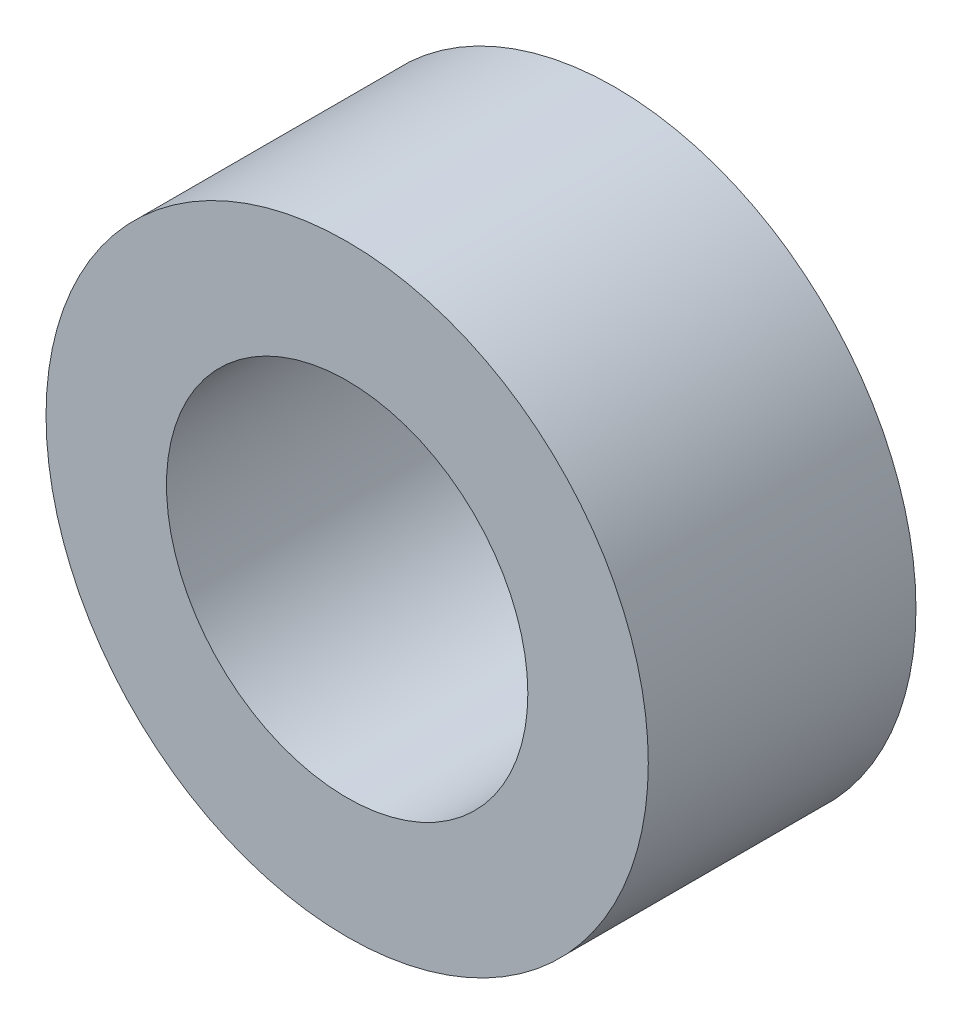
ISO-10303-21;
HEADER;
FILE_DESCRIPTION(('STEP AP214'),'2;1');
FILE_NAME('part.step','',(''),(''),'','','');
FILE_SCHEMA(('AUTOMOTIVE_DESIGN { 1 0 10303 214 1 1 1 1 }'));
ENDSEC;
DATA;
#1=APPLICATION_CONTEXT('core data for automotive mechanical design processes');
#2=APPLICATION_PROTOCOL_DEFINITION('international standard','automotive_design',2000,#1);
#3=PRODUCT_CONTEXT('',#1,'mechanical');
#4=PRODUCT('Part','Part','',(#3));
#5=PRODUCT_RELATED_PRODUCT_CATEGORY('part','',(#4));
#6=PRODUCT_DEFINITION_FORMATION('','',#4);
#7=PRODUCT_DEFINITION_CONTEXT('part definition',#1,'design');
#8=PRODUCT_DEFINITION('design','',#6,#7);
#9=PRODUCT_DEFINITION_SHAPE('','',#8);
#10=(LENGTH_UNIT() NAMED_UNIT(*) SI_UNIT(.MILLI.,.METRE.));
#11=(NAMED_UNIT(*) PLANE_ANGLE_UNIT() SI_UNIT($,.RADIAN.));
#12=(NAMED_UNIT(*) SI_UNIT($,.STERADIAN.) SOLID_ANGLE_UNIT());
#13=UNCERTAINTY_MEASURE_WITH_UNIT(LENGTH_MEASURE(1.E-05),#10,'distance_accuracy_value','');
#14=(GEOMETRIC_REPRESENTATION_CONTEXT(3) GLOBAL_UNCERTAINTY_ASSIGNED_CONTEXT((#13)) GLOBAL_UNIT_ASSIGNED_CONTEXT((#10,
#11,#12)) REPRESENTATION_CONTEXT('',''));
#15=CARTESIAN_POINT('',(0.,0.,0.));
#16=DIRECTION('',(0.,0.,1.));
#17=DIRECTION('',(1.,0.,0.));
#18=AXIS2_PLACEMENT_3D('',#15,#16,#17);
#19=CARTESIAN_POINT('',(0.,0.,1.));
#20=DIRECTION('',(0.,0.,1.));
#21=DIRECTION('',(1.,0.,0.));
#22=AXIS2_PLACEMENT_3D('',#19,#20,#21);
#23=PLANE('',#22);
#24=CARTESIAN_POINT('',(0.,0.,1.));
#25=DIRECTION('',(0.,0.,1.));
#26=DIRECTION('',(1.,0.,0.));
#27=AXIS2_PLACEMENT_3D('',#24,#25,#26);
#28=CIRCLE('',#27,2.25);
#29=CARTESIAN_POINT('',(2.25,0.,1.));
#30=VERTEX_POINT('',#29);
#31=EDGE_CURVE('E10',#30,#30,#28,.T.);
#32=ORIENTED_EDGE('',*,*,#31,.T.);
#33=EDGE_LOOP('',(#32));
#34=FACE_BOUND('',#33,.T.);
#35=CARTESIAN_POINT('',(0.,0.,1.));
#36=DIRECTION('',(0.,0.,1.));
#37=DIRECTION('',(1.,0.,0.));
#38=AXIS2_PLACEMENT_3D('',#35,#36,#37);
#39=CIRCLE('',#38,1.35);
#40=CARTESIAN_POINT('',(1.35,0.,1.));
#41=VERTEX_POINT('',#40);
#42=EDGE_CURVE('E48',#41,#41,#39,.T.);
#43=ORIENTED_EDGE('',*,*,#42,.F.);
#44=EDGE_LOOP('',(#43));
#45=FACE_BOUND('',#44,.T.);
#46=ADVANCED_FACE('F34',(#34,#45),#23,.T.);
#47=CARTESIAN_POINT('',(0.,0.,-1.));
#48=DIRECTION('',(0.,0.,1.));
#49=DIRECTION('',(1.,0.,0.));
#50=AXIS2_PLACEMENT_3D('',#47,#48,#49);
#51=PLANE('',#50);
#52=CARTESIAN_POINT('',(0.,0.,-1.));
#53=DIRECTION('',(0.,0.,1.));
#54=DIRECTION('',(1.,0.,0.));
#55=AXIS2_PLACEMENT_3D('',#52,#53,#54);
#56=CIRCLE('',#55,2.25);
#57=CARTESIAN_POINT('',(2.25,0.,-1.));
#58=VERTEX_POINT('',#57);
#59=EDGE_CURVE('E38',#58,#58,#56,.T.);
#60=ORIENTED_EDGE('',*,*,#59,.F.);
#61=EDGE_LOOP('',(#60));
#62=FACE_BOUND('',#61,.T.);
#63=CARTESIAN_POINT('',(0.,0.,-1.));
#64=DIRECTION('',(0.,0.,1.));
#65=DIRECTION('',(1.,0.,0.));
#66=AXIS2_PLACEMENT_3D('',#63,#64,#65);
#67=CIRCLE('',#66,1.35);
#68=CARTESIAN_POINT('',(1.35,0.,-1.));
#69=VERTEX_POINT('',#68);
#70=EDGE_CURVE('E50',#69,#69,#67,.T.);
#71=ORIENTED_EDGE('',*,*,#70,.T.);
#72=EDGE_LOOP('',(#71));
#73=FACE_BOUND('',#72,.T.);
#74=ADVANCED_FACE('F61',(#62,#73),#51,.F.);
#75=CARTESIAN_POINT('',(0.,0.,1.));
#76=DIRECTION('',(0.,0.,-1.));
#77=DIRECTION('',(-1.,0.,0.));
#78=AXIS2_PLACEMENT_3D('',#75,#76,#77);
#79=CYLINDRICAL_SURFACE('',#78,2.25);
#80=ORIENTED_EDGE('',*,*,#31,.F.);
#81=EDGE_LOOP('',(#80));
#82=FACE_BOUND('',#81,.T.);
#83=ORIENTED_EDGE('',*,*,#59,.T.);
#84=EDGE_LOOP('',(#83));
#85=FACE_BOUND('',#84,.T.);
#86=ADVANCED_FACE('F36',(#82,#85),#79,.T.);
#87=CARTESIAN_POINT('',(0.,0.,1.));
#88=DIRECTION('',(0.,0.,-1.));
#89=DIRECTION('',(-1.,0.,0.));
#90=AXIS2_PLACEMENT_3D('',#87,#88,#89);
#91=CYLINDRICAL_SURFACE('',#90,1.35);
#92=ORIENTED_EDGE('',*,*,#42,.T.);
#93=EDGE_LOOP('',(#92));
#94=FACE_BOUND('',#93,.T.);
#95=ORIENTED_EDGE('',*,*,#70,.F.);
#96=EDGE_LOOP('',(#95));
#97=FACE_BOUND('',#96,.T.);
#98=ADVANCED_FACE('F57',(#94,#97),#91,.F.);
#99=CLOSED_SHELL('',(#46,#74,#86,#98));
#100=MANIFOLD_SOLID_BREP('B2',#99);
#101=ADVANCED_BREP_SHAPE_REPRESENTATION('',(#18,#100),#14);
#102=SHAPE_DEFINITION_REPRESENTATION(#9,#101);
ENDSEC;
END-ISO-10303-21;
